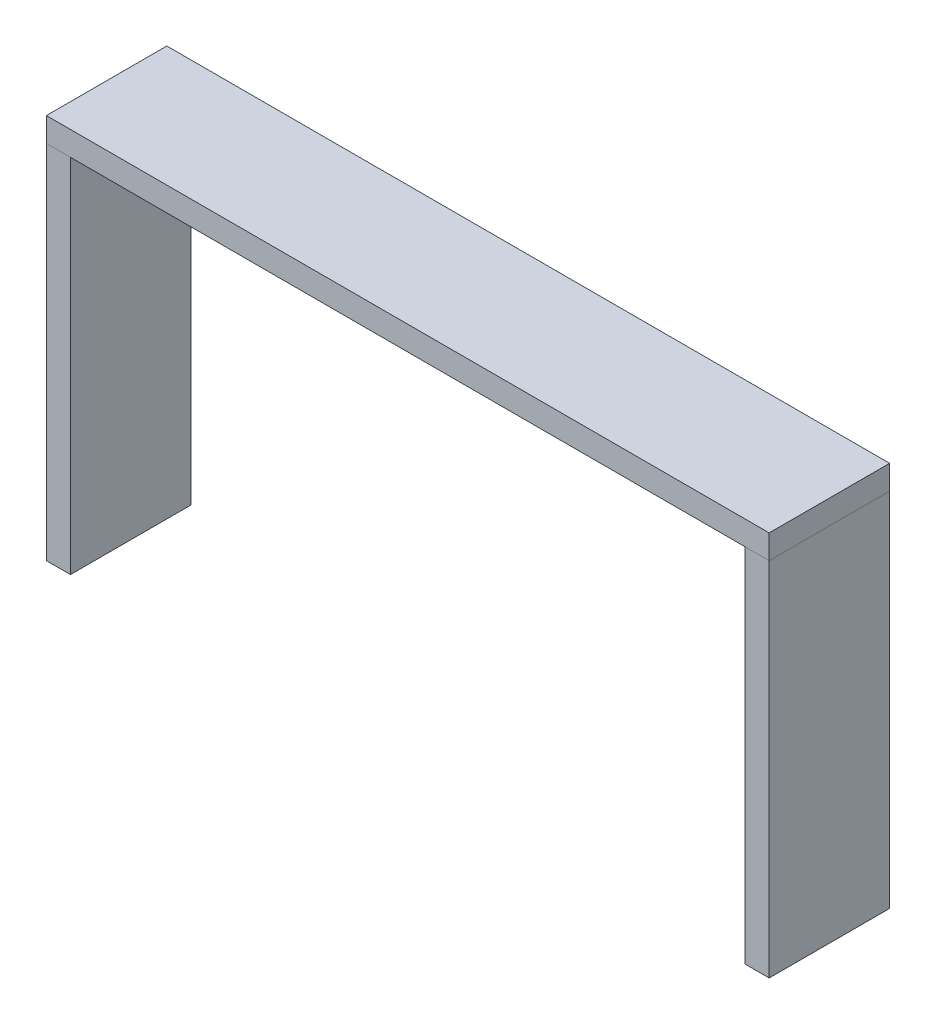
ISO-10303-21;
HEADER;
FILE_DESCRIPTION(('STEP AP214'),'2;1');
FILE_NAME('part.step','',(''),(''),'','','');
FILE_SCHEMA(('AUTOMOTIVE_DESIGN { 1 0 10303 214 1 1 1 1 }'));
ENDSEC;
DATA;
#1=APPLICATION_CONTEXT('core data for automotive mechanical design processes');
#2=APPLICATION_PROTOCOL_DEFINITION('international standard','automotive_design',2000,#1);
#3=PRODUCT_CONTEXT('',#1,'mechanical');
#4=PRODUCT('Part','Part','',(#3));
#5=PRODUCT_RELATED_PRODUCT_CATEGORY('part','',(#4));
#6=PRODUCT_DEFINITION_FORMATION('','',#4);
#7=PRODUCT_DEFINITION_CONTEXT('part definition',#1,'design');
#8=PRODUCT_DEFINITION('design','',#6,#7);
#9=PRODUCT_DEFINITION_SHAPE('','',#8);
#10=(LENGTH_UNIT() NAMED_UNIT(*) SI_UNIT(.MILLI.,.METRE.));
#11=(NAMED_UNIT(*) PLANE_ANGLE_UNIT() SI_UNIT($,.RADIAN.));
#12=(NAMED_UNIT(*) SI_UNIT($,.STERADIAN.) SOLID_ANGLE_UNIT());
#13=UNCERTAINTY_MEASURE_WITH_UNIT(LENGTH_MEASURE(1.E-05),#10,'distance_accuracy_value','');
#14=(GEOMETRIC_REPRESENTATION_CONTEXT(3) GLOBAL_UNCERTAINTY_ASSIGNED_CONTEXT((#13)) GLOBAL_UNIT_ASSIGNED_CONTEXT((#10,
#11,#12)) REPRESENTATION_CONTEXT('',''));
#15=CARTESIAN_POINT('',(0.,0.,0.));
#16=DIRECTION('',(0.,0.,1.));
#17=DIRECTION('',(1.,0.,0.));
#18=AXIS2_PLACEMENT_3D('',#15,#16,#17);
#19=CARTESIAN_POINT('',(-300.,320.,-50.));
#20=DIRECTION('',(1.,0.,0.));
#21=DIRECTION('',(0.,0.,-1.));
#22=AXIS2_PLACEMENT_3D('',#19,#20,#21);
#23=PLANE('',#22);
#24=DIRECTION('',(0.,0.,1.));
#25=VECTOR('',#24,1.);
#26=CARTESIAN_POINT('',(-300.,300.,-50.));
#27=LINE('',#26,#25);
#28=CARTESIAN_POINT('',(-300.,300.,-50.));
#29=VERTEX_POINT('',#28);
#30=CARTESIAN_POINT('',(-300.,300.,50.));
#31=VERTEX_POINT('',#30);
#32=EDGE_CURVE('E111',#29,#31,#27,.T.);
#33=ORIENTED_EDGE('',*,*,#32,.T.);
#34=DIRECTION('',(0.,-1.,0.));
#35=VECTOR('',#34,1.);
#36=CARTESIAN_POINT('',(-300.,320.,50.));
#37=LINE('',#36,#35);
#38=CARTESIAN_POINT('',(-300.,320.,50.));
#39=VERTEX_POINT('',#38);
#40=EDGE_CURVE('E12',#39,#31,#37,.T.);
#41=ORIENTED_EDGE('',*,*,#40,.F.);
#42=DIRECTION('',(0.,0.,1.));
#43=VECTOR('',#42,1.);
#44=CARTESIAN_POINT('',(-300.,320.,-50.));
#45=LINE('',#44,#43);
#46=CARTESIAN_POINT('',(-300.,320.,-50.));
#47=VERTEX_POINT('',#46);
#48=EDGE_CURVE('E99',#47,#39,#45,.T.);
#49=ORIENTED_EDGE('',*,*,#48,.F.);
#50=DIRECTION('',(0.,-1.,0.));
#51=VECTOR('',#50,1.);
#52=CARTESIAN_POINT('',(-300.,320.,-50.));
#53=LINE('',#52,#51);
#54=EDGE_CURVE('E107',#47,#29,#53,.T.);
#55=ORIENTED_EDGE('',*,*,#54,.T.);
#56=EDGE_LOOP('',(#33,#41,#49,#55));
#57=FACE_BOUND('',#56,.T.);
#58=ADVANCED_FACE('F48',(#57),#23,.F.);
#59=CARTESIAN_POINT('',(-300.,320.,50.));
#60=DIRECTION('',(0.,0.,-1.));
#61=DIRECTION('',(-1.,0.,0.));
#62=AXIS2_PLACEMENT_3D('',#59,#60,#61);
#63=PLANE('',#62);
#64=DIRECTION('',(1.,0.,0.));
#65=VECTOR('',#64,1.);
#66=CARTESIAN_POINT('',(-300.,300.,50.));
#67=LINE('',#66,#65);
#68=CARTESIAN_POINT('',(300.,300.,50.));
#69=VERTEX_POINT('',#68);
#70=EDGE_CURVE('E103',#31,#69,#67,.T.);
#71=ORIENTED_EDGE('',*,*,#70,.T.);
#72=DIRECTION('',(0.,-1.,0.));
#73=VECTOR('',#72,1.);
#74=CARTESIAN_POINT('',(300.,320.,50.));
#75=LINE('',#74,#73);
#76=CARTESIAN_POINT('',(300.,320.,50.));
#77=VERTEX_POINT('',#76);
#78=EDGE_CURVE('E56',#77,#69,#75,.T.);
#79=ORIENTED_EDGE('',*,*,#78,.F.);
#80=DIRECTION('',(1.,0.,0.));
#81=VECTOR('',#80,1.);
#82=CARTESIAN_POINT('',(-300.,320.,50.));
#83=LINE('',#82,#81);
#84=EDGE_CURVE('E94',#39,#77,#83,.T.);
#85=ORIENTED_EDGE('',*,*,#84,.F.);
#86=ORIENTED_EDGE('',*,*,#40,.T.);
#87=EDGE_LOOP('',(#71,#79,#85,#86));
#88=FACE_BOUND('',#87,.T.);
#89=ADVANCED_FACE('F102',(#88),#63,.F.);
#90=CARTESIAN_POINT('',(300.,320.,-50.));
#91=DIRECTION('',(-1.,0.,0.));
#92=DIRECTION('',(0.,0.,1.));
#93=AXIS2_PLACEMENT_3D('',#90,#91,#92);
#94=PLANE('',#93);
#95=DIRECTION('',(0.,0.,-1.));
#96=VECTOR('',#95,1.);
#97=CARTESIAN_POINT('',(300.,300.,-50.));
#98=LINE('',#97,#96);
#99=CARTESIAN_POINT('',(300.,300.,-50.));
#100=VERTEX_POINT('',#99);
#101=EDGE_CURVE('E81',#69,#100,#98,.T.);
#102=ORIENTED_EDGE('',*,*,#101,.T.);
#103=DIRECTION('',(0.,-1.,0.));
#104=VECTOR('',#103,1.);
#105=CARTESIAN_POINT('',(300.,320.,-50.));
#106=LINE('',#105,#104);
#107=CARTESIAN_POINT('',(300.,320.,-50.));
#108=VERTEX_POINT('',#107);
#109=EDGE_CURVE('E104',#108,#100,#106,.T.);
#110=ORIENTED_EDGE('',*,*,#109,.F.);
#111=DIRECTION('',(0.,0.,-1.));
#112=VECTOR('',#111,1.);
#113=CARTESIAN_POINT('',(300.,320.,-50.));
#114=LINE('',#113,#112);
#115=EDGE_CURVE('E97',#77,#108,#114,.T.);
#116=ORIENTED_EDGE('',*,*,#115,.F.);
#117=ORIENTED_EDGE('',*,*,#78,.T.);
#118=EDGE_LOOP('',(#102,#110,#116,#117));
#119=FACE_BOUND('',#118,.T.);
#120=ADVANCED_FACE('F105',(#119),#94,.F.);
#121=CARTESIAN_POINT('',(-300.,320.,-50.));
#122=DIRECTION('',(0.,0.,1.));
#123=DIRECTION('',(1.,0.,0.));
#124=AXIS2_PLACEMENT_3D('',#121,#122,#123);
#125=PLANE('',#124);
#126=DIRECTION('',(-1.,0.,0.));
#127=VECTOR('',#126,1.);
#128=CARTESIAN_POINT('',(-300.,300.,-50.));
#129=LINE('',#128,#127);
#130=EDGE_CURVE('E87',#100,#29,#129,.T.);
#131=ORIENTED_EDGE('',*,*,#130,.T.);
#132=ORIENTED_EDGE('',*,*,#54,.F.);
#133=DIRECTION('',(-1.,0.,0.));
#134=VECTOR('',#133,1.);
#135=CARTESIAN_POINT('',(-300.,320.,-50.));
#136=LINE('',#135,#134);
#137=EDGE_CURVE('E64',#108,#47,#136,.T.);
#138=ORIENTED_EDGE('',*,*,#137,.F.);
#139=ORIENTED_EDGE('',*,*,#109,.T.);
#140=EDGE_LOOP('',(#131,#132,#138,#139));
#141=FACE_BOUND('',#140,.T.);
#142=ADVANCED_FACE('F118',(#141),#125,.F.);
#143=CARTESIAN_POINT('',(0.,320.,0.));
#144=DIRECTION('',(0.,1.,0.));
#145=DIRECTION('',(0.,0.,1.));
#146=AXIS2_PLACEMENT_3D('',#143,#144,#145);
#147=PLANE('',#146);
#148=ORIENTED_EDGE('',*,*,#48,.T.);
#149=ORIENTED_EDGE('',*,*,#84,.T.);
#150=ORIENTED_EDGE('',*,*,#115,.T.);
#151=ORIENTED_EDGE('',*,*,#137,.T.);
#152=EDGE_LOOP('',(#148,#149,#150,#151));
#153=FACE_BOUND('',#152,.T.);
#154=ADVANCED_FACE('F95',(#153),#147,.T.);
#155=CARTESIAN_POINT('',(0.,300.,0.));
#156=DIRECTION('',(0.,1.,0.));
#157=DIRECTION('',(0.,0.,1.));
#158=AXIS2_PLACEMENT_3D('',#155,#156,#157);
#159=PLANE('',#158);
#160=ORIENTED_EDGE('',*,*,#32,.F.);
#161=ORIENTED_EDGE('',*,*,#130,.F.);
#162=ORIENTED_EDGE('',*,*,#101,.F.);
#163=ORIENTED_EDGE('',*,*,#70,.F.);
#164=EDGE_LOOP('',(#160,#161,#162,#163));
#165=FACE_BOUND('',#164,.T.);
#166=ADVANCED_FACE('F121',(#165),#159,.F.);
#167=CLOSED_SHELL('',(#58,#89,#120,#142,#154,#166));
#168=MANIFOLD_SOLID_BREP('B2',#167);
#169=CARTESIAN_POINT('',(280.,300.,50.));
#170=DIRECTION('',(1.,0.,0.));
#171=DIRECTION('',(0.,0.,-1.));
#172=AXIS2_PLACEMENT_3D('',#169,#170,#171);
#173=PLANE('',#172);
#174=DIRECTION('',(0.,0.,1.));
#175=VECTOR('',#174,1.);
#176=CARTESIAN_POINT('',(280.,0.,50.));
#177=LINE('',#176,#175);
#178=CARTESIAN_POINT('',(280.,0.,-50.0000000000001));
#179=VERTEX_POINT('',#178);
#180=CARTESIAN_POINT('',(280.,0.,50.));
#181=VERTEX_POINT('',#180);
#182=EDGE_CURVE('E244',#179,#181,#177,.T.);
#183=ORIENTED_EDGE('',*,*,#182,.T.);
#184=DIRECTION('',(0.,-1.,0.));
#185=VECTOR('',#184,1.);
#186=CARTESIAN_POINT('',(280.,300.,50.));
#187=LINE('',#186,#185);
#188=CARTESIAN_POINT('',(280.,300.,50.));
#189=VERTEX_POINT('',#188);
#190=EDGE_CURVE('E46',#189,#181,#187,.T.);
#191=ORIENTED_EDGE('',*,*,#190,.F.);
#192=DIRECTION('',(0.,0.,1.));
#193=VECTOR('',#192,1.);
#194=CARTESIAN_POINT('',(280.,300.,50.));
#195=LINE('',#194,#193);
#196=CARTESIAN_POINT('',(280.,300.,-50.0000000000001));
#197=VERTEX_POINT('',#196);
#198=EDGE_CURVE('E232',#197,#189,#195,.T.);
#199=ORIENTED_EDGE('',*,*,#198,.F.);
#200=DIRECTION('',(0.,-1.,0.));
#201=VECTOR('',#200,1.);
#202=CARTESIAN_POINT('',(280.,300.,-50.0000000000001));
#203=LINE('',#202,#201);
#204=EDGE_CURVE('E240',#197,#179,#203,.T.);
#205=ORIENTED_EDGE('',*,*,#204,.T.);
#206=EDGE_LOOP('',(#183,#191,#199,#205));
#207=FACE_BOUND('',#206,.T.);
#208=ADVANCED_FACE('F181',(#207),#173,.F.);
#209=CARTESIAN_POINT('',(280.,300.,50.));
#210=DIRECTION('',(0.,0.,-1.));
#211=DIRECTION('',(-1.,0.,0.));
#212=AXIS2_PLACEMENT_3D('',#209,#210,#211);
#213=PLANE('',#212);
#214=DIRECTION('',(1.,0.,0.));
#215=VECTOR('',#214,1.);
#216=CARTESIAN_POINT('',(280.,0.,50.));
#217=LINE('',#216,#215);
#218=CARTESIAN_POINT('',(300.,0.,50.));
#219=VERTEX_POINT('',#218);
#220=EDGE_CURVE('E236',#181,#219,#217,.T.);
#221=ORIENTED_EDGE('',*,*,#220,.T.);
#222=DIRECTION('',(0.,-1.,0.));
#223=VECTOR('',#222,1.);
#224=CARTESIAN_POINT('',(300.,300.,50.));
#225=LINE('',#224,#223);
#226=CARTESIAN_POINT('',(300.,300.,50.));
#227=VERTEX_POINT('',#226);
#228=EDGE_CURVE('E189',#227,#219,#225,.T.);
#229=ORIENTED_EDGE('',*,*,#228,.F.);
#230=DIRECTION('',(1.,0.,0.));
#231=VECTOR('',#230,1.);
#232=CARTESIAN_POINT('',(280.,300.,50.));
#233=LINE('',#232,#231);
#234=EDGE_CURVE('E227',#189,#227,#233,.T.);
#235=ORIENTED_EDGE('',*,*,#234,.F.);
#236=ORIENTED_EDGE('',*,*,#190,.T.);
#237=EDGE_LOOP('',(#221,#229,#235,#236));
#238=FACE_BOUND('',#237,.T.);
#239=ADVANCED_FACE('F235',(#238),#213,.F.);
#240=CARTESIAN_POINT('',(300.,300.,50.));
#241=DIRECTION('',(-1.,0.,0.));
#242=DIRECTION('',(0.,0.,1.));
#243=AXIS2_PLACEMENT_3D('',#240,#241,#242);
#244=PLANE('',#243);
#245=DIRECTION('',(0.,0.,-1.));
#246=VECTOR('',#245,1.);
#247=CARTESIAN_POINT('',(300.,0.,50.));
#248=LINE('',#247,#246);
#249=CARTESIAN_POINT('',(300.,0.,-50.0000000000001));
#250=VERTEX_POINT('',#249);
#251=EDGE_CURVE('E214',#219,#250,#248,.T.);
#252=ORIENTED_EDGE('',*,*,#251,.T.);
#253=DIRECTION('',(0.,-1.,0.));
#254=VECTOR('',#253,1.);
#255=CARTESIAN_POINT('',(300.,300.,-50.0000000000001));
#256=LINE('',#255,#254);
#257=CARTESIAN_POINT('',(300.,300.,-50.0000000000001));
#258=VERTEX_POINT('',#257);
#259=EDGE_CURVE('E237',#258,#250,#256,.T.);
#260=ORIENTED_EDGE('',*,*,#259,.F.);
#261=DIRECTION('',(0.,0.,-1.));
#262=VECTOR('',#261,1.);
#263=CARTESIAN_POINT('',(300.,300.,50.));
#264=LINE('',#263,#262);
#265=EDGE_CURVE('E230',#227,#258,#264,.T.);
#266=ORIENTED_EDGE('',*,*,#265,.F.);
#267=ORIENTED_EDGE('',*,*,#228,.T.);
#268=EDGE_LOOP('',(#252,#260,#266,#267));
#269=FACE_BOUND('',#268,.T.);
#270=ADVANCED_FACE('F238',(#269),#244,.F.);
#271=CARTESIAN_POINT('',(280.,300.,-50.0000000000001));
#272=DIRECTION('',(0.,0.,1.));
#273=DIRECTION('',(1.,0.,0.));
#274=AXIS2_PLACEMENT_3D('',#271,#272,#273);
#275=PLANE('',#274);
#276=DIRECTION('',(-1.,0.,0.));
#277=VECTOR('',#276,1.);
#278=CARTESIAN_POINT('',(280.,0.,-50.0000000000001));
#279=LINE('',#278,#277);
#280=EDGE_CURVE('E220',#250,#179,#279,.T.);
#281=ORIENTED_EDGE('',*,*,#280,.T.);
#282=ORIENTED_EDGE('',*,*,#204,.F.);
#283=DIRECTION('',(-1.,0.,0.));
#284=VECTOR('',#283,1.);
#285=CARTESIAN_POINT('',(280.,300.,-50.0000000000001));
#286=LINE('',#285,#284);
#287=EDGE_CURVE('E197',#258,#197,#286,.T.);
#288=ORIENTED_EDGE('',*,*,#287,.F.);
#289=ORIENTED_EDGE('',*,*,#259,.T.);
#290=EDGE_LOOP('',(#281,#282,#288,#289));
#291=FACE_BOUND('',#290,.T.);
#292=ADVANCED_FACE('F251',(#291),#275,.F.);
#293=CARTESIAN_POINT('',(0.,300.,0.));
#294=DIRECTION('',(0.,-1.,0.));
#295=DIRECTION('',(0.,0.,-1.));
#296=AXIS2_PLACEMENT_3D('',#293,#294,#295);
#297=PLANE('',#296);
#298=ORIENTED_EDGE('',*,*,#198,.T.);
#299=ORIENTED_EDGE('',*,*,#234,.T.);
#300=ORIENTED_EDGE('',*,*,#265,.T.);
#301=ORIENTED_EDGE('',*,*,#287,.T.);
#302=EDGE_LOOP('',(#298,#299,#300,#301));
#303=FACE_BOUND('',#302,.T.);
#304=ADVANCED_FACE('F228',(#303),#297,.F.);
#305=CARTESIAN_POINT('',(0.,0.,0.));
#306=DIRECTION('',(0.,-1.,0.));
#307=DIRECTION('',(0.,0.,-1.));
#308=AXIS2_PLACEMENT_3D('',#305,#306,#307);
#309=PLANE('',#308);
#310=ORIENTED_EDGE('',*,*,#182,.F.);
#311=ORIENTED_EDGE('',*,*,#280,.F.);
#312=ORIENTED_EDGE('',*,*,#251,.F.);
#313=ORIENTED_EDGE('',*,*,#220,.F.);
#314=EDGE_LOOP('',(#310,#311,#312,#313));
#315=FACE_BOUND('',#314,.T.);
#316=ADVANCED_FACE('F254',(#315),#309,.T.);
#317=CLOSED_SHELL('',(#208,#239,#270,#292,#304,#316));
#318=MANIFOLD_SOLID_BREP('B6',#317);
#319=CARTESIAN_POINT('',(-300.,300.,50.));
#320=DIRECTION('',(1.,0.,0.));
#321=DIRECTION('',(0.,0.,-1.));
#322=AXIS2_PLACEMENT_3D('',#319,#320,#321);
#323=PLANE('',#322);
#324=DIRECTION('',(0.,0.,1.));
#325=VECTOR('',#324,1.);
#326=CARTESIAN_POINT('',(-300.,0.,50.));
#327=LINE('',#326,#325);
#328=CARTESIAN_POINT('',(-300.,0.,-50.));
#329=VERTEX_POINT('',#328);
#330=CARTESIAN_POINT('',(-300.,0.,50.));
#331=VERTEX_POINT('',#330);
#332=EDGE_CURVE('E368',#329,#331,#327,.T.);
#333=ORIENTED_EDGE('',*,*,#332,.T.);
#334=DIRECTION('',(0.,-1.,0.));
#335=VECTOR('',#334,1.);
#336=CARTESIAN_POINT('',(-300.,300.,50.));
#337=LINE('',#336,#335);
#338=CARTESIAN_POINT('',(-300.,300.,50.));
#339=VERTEX_POINT('',#338);
#340=EDGE_CURVE('E179',#339,#331,#337,.T.);
#341=ORIENTED_EDGE('',*,*,#340,.F.);
#342=DIRECTION('',(0.,0.,1.));
#343=VECTOR('',#342,1.);
#344=CARTESIAN_POINT('',(-300.,300.,50.));
#345=LINE('',#344,#343);
#346=CARTESIAN_POINT('',(-300.,300.,-50.));
#347=VERTEX_POINT('',#346);
#348=EDGE_CURVE('E356',#347,#339,#345,.T.);
#349=ORIENTED_EDGE('',*,*,#348,.F.);
#350=DIRECTION('',(0.,-1.,0.));
#351=VECTOR('',#350,1.);
#352=CARTESIAN_POINT('',(-300.,300.,-50.));
#353=LINE('',#352,#351);
#354=EDGE_CURVE('E364',#347,#329,#353,.T.);
#355=ORIENTED_EDGE('',*,*,#354,.T.);
#356=EDGE_LOOP('',(#333,#341,#349,#355));
#357=FACE_BOUND('',#356,.T.);
#358=ADVANCED_FACE('F305',(#357),#323,.F.);
#359=CARTESIAN_POINT('',(-280.,300.,50.));
#360=DIRECTION('',(0.,0.,-1.));
#361=DIRECTION('',(-1.,0.,0.));
#362=AXIS2_PLACEMENT_3D('',#359,#360,#361);
#363=PLANE('',#362);
#364=DIRECTION('',(1.,0.,0.));
#365=VECTOR('',#364,1.);
#366=CARTESIAN_POINT('',(-280.,0.,50.));
#367=LINE('',#366,#365);
#368=CARTESIAN_POINT('',(-280.,0.,50.));
#369=VERTEX_POINT('',#368);
#370=EDGE_CURVE('E360',#331,#369,#367,.T.);
#371=ORIENTED_EDGE('',*,*,#370,.T.);
#372=DIRECTION('',(0.,-1.,0.));
#373=VECTOR('',#372,1.);
#374=CARTESIAN_POINT('',(-280.,300.,50.));
#375=LINE('',#374,#373);
#376=CARTESIAN_POINT('',(-280.,300.,50.));
#377=VERTEX_POINT('',#376);
#378=EDGE_CURVE('E313',#377,#369,#375,.T.);
#379=ORIENTED_EDGE('',*,*,#378,.F.);
#380=DIRECTION('',(1.,0.,0.));
#381=VECTOR('',#380,1.);
#382=CARTESIAN_POINT('',(-280.,300.,50.));
#383=LINE('',#382,#381);
#384=EDGE_CURVE('E351',#339,#377,#383,.T.);
#385=ORIENTED_EDGE('',*,*,#384,.F.);
#386=ORIENTED_EDGE('',*,*,#340,.T.);
#387=EDGE_LOOP('',(#371,#379,#385,#386));
#388=FACE_BOUND('',#387,.T.);
#389=ADVANCED_FACE('F359',(#388),#363,.F.);
#390=CARTESIAN_POINT('',(-280.,300.,50.));
#391=DIRECTION('',(-1.,0.,0.));
#392=DIRECTION('',(0.,0.,1.));
#393=AXIS2_PLACEMENT_3D('',#390,#391,#392);
#394=PLANE('',#393);
#395=DIRECTION('',(0.,0.,-1.));
#396=VECTOR('',#395,1.);
#397=CARTESIAN_POINT('',(-280.,0.,50.));
#398=LINE('',#397,#396);
#399=CARTESIAN_POINT('',(-280.,0.,-50.));
#400=VERTEX_POINT('',#399);
#401=EDGE_CURVE('E338',#369,#400,#398,.T.);
#402=ORIENTED_EDGE('',*,*,#401,.T.);
#403=DIRECTION('',(0.,-1.,0.));
#404=VECTOR('',#403,1.);
#405=CARTESIAN_POINT('',(-280.,300.,-50.));
#406=LINE('',#405,#404);
#407=CARTESIAN_POINT('',(-280.,300.,-50.));
#408=VERTEX_POINT('',#407);
#409=EDGE_CURVE('E361',#408,#400,#406,.T.);
#410=ORIENTED_EDGE('',*,*,#409,.F.);
#411=DIRECTION('',(0.,0.,-1.));
#412=VECTOR('',#411,1.);
#413=CARTESIAN_POINT('',(-280.,300.,50.));
#414=LINE('',#413,#412);
#415=EDGE_CURVE('E354',#377,#408,#414,.T.);
#416=ORIENTED_EDGE('',*,*,#415,.F.);
#417=ORIENTED_EDGE('',*,*,#378,.T.);
#418=EDGE_LOOP('',(#402,#410,#416,#417));
#419=FACE_BOUND('',#418,.T.);
#420=ADVANCED_FACE('F362',(#419),#394,.F.);
#421=CARTESIAN_POINT('',(-280.,300.,-50.));
#422=DIRECTION('',(0.,0.,1.));
#423=DIRECTION('',(1.,0.,0.));
#424=AXIS2_PLACEMENT_3D('',#421,#422,#423);
#425=PLANE('',#424);
#426=DIRECTION('',(-1.,0.,0.));
#427=VECTOR('',#426,1.);
#428=CARTESIAN_POINT('',(-280.,0.,-50.));
#429=LINE('',#428,#427);
#430=EDGE_CURVE('E344',#400,#329,#429,.T.);
#431=ORIENTED_EDGE('',*,*,#430,.T.);
#432=ORIENTED_EDGE('',*,*,#354,.F.);
#433=DIRECTION('',(-1.,0.,0.));
#434=VECTOR('',#433,1.);
#435=CARTESIAN_POINT('',(-280.,300.,-50.));
#436=LINE('',#435,#434);
#437=EDGE_CURVE('E321',#408,#347,#436,.T.);
#438=ORIENTED_EDGE('',*,*,#437,.F.);
#439=ORIENTED_EDGE('',*,*,#409,.T.);
#440=EDGE_LOOP('',(#431,#432,#438,#439));
#441=FACE_BOUND('',#440,.T.);
#442=ADVANCED_FACE('F375',(#441),#425,.F.);
#443=CARTESIAN_POINT('',(0.,300.,0.));
#444=DIRECTION('',(0.,1.,0.));
#445=DIRECTION('',(0.,0.,1.));
#446=AXIS2_PLACEMENT_3D('',#443,#444,#445);
#447=PLANE('',#446);
#448=ORIENTED_EDGE('',*,*,#348,.T.);
#449=ORIENTED_EDGE('',*,*,#384,.T.);
#450=ORIENTED_EDGE('',*,*,#415,.T.);
#451=ORIENTED_EDGE('',*,*,#437,.T.);
#452=EDGE_LOOP('',(#448,#449,#450,#451));
#453=FACE_BOUND('',#452,.T.);
#454=ADVANCED_FACE('F352',(#453),#447,.T.);
#455=CARTESIAN_POINT('',(0.,0.,0.));
#456=DIRECTION('',(0.,1.,0.));
#457=DIRECTION('',(0.,0.,1.));
#458=AXIS2_PLACEMENT_3D('',#455,#456,#457);
#459=PLANE('',#458);
#460=ORIENTED_EDGE('',*,*,#332,.F.);
#461=ORIENTED_EDGE('',*,*,#430,.F.);
#462=ORIENTED_EDGE('',*,*,#401,.F.);
#463=ORIENTED_EDGE('',*,*,#370,.F.);
#464=EDGE_LOOP('',(#460,#461,#462,#463));
#465=FACE_BOUND('',#464,.T.);
#466=ADVANCED_FACE('F378',(#465),#459,.F.);
#467=CLOSED_SHELL('',(#358,#389,#420,#442,#454,#466));
#468=MANIFOLD_SOLID_BREP('B40',#467);
#469=ADVANCED_BREP_SHAPE_REPRESENTATION('',(#18,#168,#318,#468),#14);
#470=SHAPE_DEFINITION_REPRESENTATION(#9,#469);
ENDSEC;
END-ISO-10303-21;
